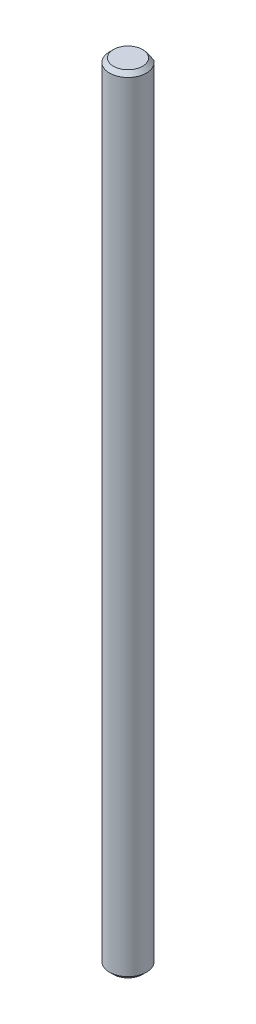
ISO-10303-21;
HEADER;
FILE_DESCRIPTION(('STEP AP214'),'2;1');
FILE_NAME('part.step','',(''),(''),'','','');
FILE_SCHEMA(('AUTOMOTIVE_DESIGN { 1 0 10303 214 1 1 1 1 }'));
ENDSEC;
DATA;
#1=APPLICATION_CONTEXT('core data for automotive mechanical design processes');
#2=APPLICATION_PROTOCOL_DEFINITION('international standard','automotive_design',2000,#1);
#3=PRODUCT_CONTEXT('',#1,'mechanical');
#4=PRODUCT('Part','Part','',(#3));
#5=PRODUCT_RELATED_PRODUCT_CATEGORY('part','',(#4));
#6=PRODUCT_DEFINITION_FORMATION('','',#4);
#7=PRODUCT_DEFINITION_CONTEXT('part definition',#1,'design');
#8=PRODUCT_DEFINITION('design','',#6,#7);
#9=PRODUCT_DEFINITION_SHAPE('','',#8);
#10=(LENGTH_UNIT() NAMED_UNIT(*) SI_UNIT(.MILLI.,.METRE.));
#11=(NAMED_UNIT(*) PLANE_ANGLE_UNIT() SI_UNIT($,.RADIAN.));
#12=(NAMED_UNIT(*) SI_UNIT($,.STERADIAN.) SOLID_ANGLE_UNIT());
#13=UNCERTAINTY_MEASURE_WITH_UNIT(LENGTH_MEASURE(1.E-05),#10,'distance_accuracy_value','');
#14=(GEOMETRIC_REPRESENTATION_CONTEXT(3) GLOBAL_UNCERTAINTY_ASSIGNED_CONTEXT((#13)) GLOBAL_UNIT_ASSIGNED_CONTEXT((#10,
#11,#12)) REPRESENTATION_CONTEXT('',''));
#15=CARTESIAN_POINT('',(0.,0.,0.));
#16=DIRECTION('',(0.,0.,1.));
#17=DIRECTION('',(1.,0.,0.));
#18=AXIS2_PLACEMENT_3D('',#15,#16,#17);
#19=CARTESIAN_POINT('',(0.,-50.,0.));
#20=DIRECTION('',(0.,-1.,0.));
#21=DIRECTION('',(1.,0.,0.));
#22=AXIS2_PLACEMENT_3D('',#19,#20,#21);
#23=PLANE('',#22);
#24=CARTESIAN_POINT('',(0.,-50.0000000000114,0.));
#25=DIRECTION('',(0.,1.,0.));
#26=DIRECTION('',(0.,0.,1.));
#27=AXIS2_PLACEMENT_3D('',#24,#25,#26);
#28=CIRCLE('',#27,1.84999999993351);
#29=CARTESIAN_POINT('',(0.,-50.0000000000114,1.84999999993351));
#30=VERTEX_POINT('',#29);
#31=EDGE_CURVE('E18',#30,#30,#28,.T.);
#32=ORIENTED_EDGE('',*,*,#31,.F.);
#33=EDGE_LOOP('',(#32));
#34=FACE_BOUND('',#33,.T.);
#35=ADVANCED_FACE('F15',(#34),#23,.T.);
#36=CARTESIAN_POINT('',(-1.85,50.,0.));
#37=DIRECTION('',(0.,1.,0.));
#38=DIRECTION('',(-1.,0.,0.));
#39=AXIS2_PLACEMENT_3D('',#36,#37,#38);
#40=PLANE('',#39);
#41=CARTESIAN_POINT('',(0.,50.0000000000114,0.));
#42=DIRECTION('',(0.,-1.,0.));
#43=DIRECTION('',(0.,0.,-1.));
#44=AXIS2_PLACEMENT_3D('',#41,#42,#43);
#45=CIRCLE('',#44,1.84999999999036);
#46=CARTESIAN_POINT('',(0.,50.0000000000114,-1.84999999999036));
#47=VERTEX_POINT('',#46);
#48=EDGE_CURVE('E47',#47,#47,#45,.T.);
#49=ORIENTED_EDGE('',*,*,#48,.F.);
#50=EDGE_LOOP('',(#49));
#51=FACE_BOUND('',#50,.T.);
#52=ADVANCED_FACE('F92',(#51),#40,.T.);
#53=CARTESIAN_POINT('',(0.,-49.4999999999663,0.));
#54=DIRECTION('',(0.,1.,0.));
#55=DIRECTION('',(0.,0.,1.));
#56=AXIS2_PLACEMENT_3D('',#53,#54,#55);
#57=CONICAL_SURFACE('',#56,2.35000000003538,0.785398163454292);
#58=ORIENTED_EDGE('',*,*,#31,.T.);
#59=EDGE_LOOP('',(#58));
#60=FACE_BOUND('',#59,.T.);
#61=CARTESIAN_POINT('',(0.,-49.5,0.));
#62=DIRECTION('',(0.,1.,0.));
#63=DIRECTION('',(-1.,0.,0.));
#64=AXIS2_PLACEMENT_3D('',#61,#62,#63);
#65=CIRCLE('',#64,2.34999999999999);
#66=CARTESIAN_POINT('',(-1.42323534764236,-49.500000243665,-1.87));
#67=VERTEX_POINT('',#66);
#68=CARTESIAN_POINT('',(1.42323462760378,-49.5000006797432,-1.87));
#69=VERTEX_POINT('',#68);
#70=EDGE_CURVE('E48',#67,#69,#65,.T.);
#71=ORIENTED_EDGE('',*,*,#70,.F.);
#72=CARTESIAN_POINT('',(-1.42323498378485,-49.5000005508551,-1.87000014038777));
#73=CARTESIAN_POINT('',(-1.35418817664827,-49.5417684632873,-1.87000005053875));
#74=CARTESIAN_POINT('',(-1.28428005161818,-49.5822263208198,-1.87000001357401));
#75=CARTESIAN_POINT('',(-1.14218468500488,-49.659597976272,-1.86999998637286));
#76=CARTESIAN_POINT('',(-1.06998959252105,-49.6964972798566,-1.86999999631996));
#77=CARTESIAN_POINT('',(-0.921895947289953,-49.7661442259493,-1.8700000037505));
#78=CARTESIAN_POINT('',(-0.845952955132971,-49.7987988696207,-1.87000000099171));
#79=CARTESIAN_POINT('',(-0.691616459482524,-49.8574751674493,-1.86999999900981));
#80=CARTESIAN_POINT('',(-0.613226862641982,-49.8835068439403,-1.86999999978133));
#81=CARTESIAN_POINT('',(-0.479182866712584,-49.9202926551231,-1.87000000014983));
#82=CARTESIAN_POINT('',(-0.424141514682739,-49.9332763724717,-1.87000000004014));
#83=CARTESIAN_POINT('',(-0.313171322830666,-49.954738551357,-1.86999999995987));
#84=CARTESIAN_POINT('',(-0.257242475405086,-49.9632169742746,-1.8699999999893));
#85=CARTESIAN_POINT('',(-0.145366352650471,-49.9751751810981,-1.87000000001061));
#86=CARTESIAN_POINT('',(-0.0894239840416926,-49.978700250427,-1.87000000000285));
#87=CARTESIAN_POINT('',(0.0225499865273419,-49.9807019187033,-1.86999999999716));
#88=CARTESIAN_POINT('',(0.0785815846536717,-49.9791787290053,-1.86999999999924));
#89=CARTESIAN_POINT('',(0.190200009157418,-49.971175482336,-1.87000000000077));
#90=CARTESIAN_POINT('',(0.245787382268125,-49.9647029657744,-1.87000000000021));
#91=CARTESIAN_POINT('',(0.356240000227504,-49.947152770313,-1.8699999999998));
#92=CARTESIAN_POINT('',(0.411104874902264,-49.936072818769,-1.86999999999993));
#93=CARTESIAN_POINT('',(0.575088112093169,-49.8964582598053,-1.87000000000015));
#94=CARTESIAN_POINT('',(0.682710045112367,-49.8616255993898,-1.87000000000003));
#95=CARTESIAN_POINT('',(0.843715590708974,-49.7991245084334,-1.86999999999999));
#96=CARTESIAN_POINT('',(0.898885600992475,-49.7757462694812,-1.87));
#97=CARTESIAN_POINT('',(1.0079828095392,-49.7261890409873,-1.87000000000001));
#98=CARTESIAN_POINT('',(1.06190968444336,-49.7000093325114,-1.87000000000001));
#99=CARTESIAN_POINT('',(1.16766384505703,-49.645843484592,-1.87));
#100=CARTESIAN_POINT('',(1.21951129441643,-49.6178962101573,-1.87));
#101=CARTESIAN_POINT('',(1.32213346308007,-49.5602061758245,-1.87000000000001));
#102=CARTESIAN_POINT('',(1.37290918064455,-49.5304651962072,-1.87000000000001));
#103=CARTESIAN_POINT('',(1.42323358507355,-49.5000013111337,-1.87000000000001));
#104=B_SPLINE_CURVE_WITH_KNOTS('',3,(#72,#73,#74,#75,#76,#77,#78,#79,#80,#81,#82,#83,#84,#85,
#86,#87,#88,#89,#90,#91,#92,#93,#94,#95,#96,#97,#98,#99,#100,#101,#102,#103),.UNSPECIFIED.,.F.,
.F.,(4,2,2,2,2,2,2,2,2,2,2,2,2,2,2,4),(0.,0.242165576525823,0.485279183301244,0.733046787022982,
0.980437191076499,1.14993280226235,1.31942986633639,1.48736701288445,1.6552971285237,
1.82297190738139,1.99072949108785,2.32888004133284,2.50859200291018,2.68835019463475,
2.86501326623594,3.04150379386995),.UNSPECIFIED.);
#105=EDGE_CURVE('E40',#67,#69,#104,.T.);
#106=ORIENTED_EDGE('',*,*,#105,.T.);
#107=EDGE_LOOP('',(#71,#106));
#108=FACE_BOUND('',#107,.T.);
#109=ADVANCED_FACE('F49',(#60,#108),#57,.T.);
#110=CARTESIAN_POINT('',(0.,-50.,-1.87000000000001));
#111=DIRECTION('',(0.,0.,1.));
#112=DIRECTION('',(1.,0.,0.));
#113=AXIS2_PLACEMENT_3D('',#110,#111,#112);
#114=PLANE('',#113);
#115=CARTESIAN_POINT('',(1.42323690101391,49.4999993028939,-1.87000000000001));
#116=CARTESIAN_POINT('',(1.35419009472602,49.5417673066685,-1.87000000000001));
#117=CARTESIAN_POINT('',(1.28428195715561,49.5822252331758,-1.87000000000001));
#118=CARTESIAN_POINT('',(1.1421865542053,49.6595970094864,-1.87000000000001));
#119=CARTESIAN_POINT('',(1.06999143790243,49.6964963649345,-1.87000000000001));
#120=CARTESIAN_POINT('',(0.921897740908179,49.7661434302724,-1.87000000000001));
#121=CARTESIAN_POINT('',(0.845954720653814,49.7987981411116,-1.87000000000001));
#122=CARTESIAN_POINT('',(0.691618164416713,49.8574745764396,-1.87000000000001));
#123=CARTESIAN_POINT('',(0.613228535078765,49.8835063232211,-1.87000000000001));
#124=CARTESIAN_POINT('',(0.479184506187486,49.9202922475761,-1.87000000000001));
#125=CARTESIAN_POINT('',(0.424143155755424,49.9332760090939,-1.87000000000001));
#126=CARTESIAN_POINT('',(0.313172964139737,49.9547382799573,-1.87000000000001));
#127=CARTESIAN_POINT('',(0.257244115354621,49.9632167506934,-1.87000000000001));
#128=CARTESIAN_POINT('',(0.145367987246501,49.9751750543069,-1.87000000000001));
#129=CARTESIAN_POINT('',(0.0894256146951669,49.9787001727176,-1.87000000000001));
#130=CARTESIAN_POINT('',(-0.0225483682368413,49.9807019384361,-1.87000000000001));
#131=CARTESIAN_POINT('',(-0.0785799747834129,49.979178797098,-1.87000000000001));
#132=CARTESIAN_POINT('',(-0.190198422823108,49.9711756434597,-1.87000000000001));
#133=CARTESIAN_POINT('',(-0.245785811026135,49.9647031713364,-1.87000000000001));
#134=CARTESIAN_POINT('',(-0.356238461953535,49.9471530590305,-1.87000000000001));
#135=CARTESIAN_POINT('',(-0.411103354505624,49.9360731462025,-1.87000000000001));
#136=CARTESIAN_POINT('',(-0.575086652121821,49.8964586928644,-1.87000000000001));
#137=CARTESIAN_POINT('',(-0.682708629689933,49.8616260884606,-1.87000000000001));
#138=CARTESIAN_POINT('',(-0.843714607573762,49.7991249223591,-1.87000000000001));
#139=CARTESIAN_POINT('',(-0.898884997287229,49.7757465389586,-1.87000000000001));
#140=CARTESIAN_POINT('',(-1.00798294807066,49.7261889828608,-1.87000000000001));
#141=CARTESIAN_POINT('',(-1.06191018576471,49.7000090911917,-1.87000000000001));
#142=CARTESIAN_POINT('',(-1.16766504330868,49.6458428556734,-1.87000000000001));
#143=CARTESIAN_POINT('',(-1.2195128272266,49.617895377614,-1.87000000000001));
#144=CARTESIAN_POINT('',(-1.32213565126447,49.56020491691,-1.87000000000001));
#145=CARTESIAN_POINT('',(-1.37291168968057,49.5304637146085,-1.87000000000001));
#146=CARTESIAN_POINT('',(-1.42323641006309,49.4999996002296,-1.87000000000001));
#147=B_SPLINE_CURVE_WITH_KNOTS('',3,(#115,#116,#117,#118,#119,#120,#121,#122,#123,#124,#125,
#126,#127,#128,#129,#130,#131,#132,#133,#134,#135,#136,#137,#138,#139,#140,#141,#142,#143,#144,
#145,#146),.UNSPECIFIED.,.F.,.F.,(4,2,2,2,2,2,2,2,2,2,2,2,2,2,2,4),(0.,0.242165712962312,
0.485279453698024,0.733047215432901,0.980437778634138,1.14993341592842,1.31943050575031,
1.48736767343369,1.65529781022806,1.82297261827997,1.99073023113985,2.32888085368115,
2.50859403086456,2.688353440281,2.86501768462266,3.04150937970759),.UNSPECIFIED.);
#148=CARTESIAN_POINT('',(1.42323632549647,49.4999996514449,-1.87));
#149=VERTEX_POINT('',#148);
#150=CARTESIAN_POINT('',(-1.42323610566057,49.4999997845856,-1.87));
#151=VERTEX_POINT('',#150);
#152=EDGE_CURVE('E32',#149,#151,#147,.T.);
#153=ORIENTED_EDGE('',*,*,#152,.F.);
#154=DIRECTION('',(0.,1.,0.));
#155=VECTOR('',#154,1.);
#156=CARTESIAN_POINT('',(1.42323574997256,50.,-1.87));
#157=LINE('',#156,#155);
#158=EDGE_CURVE('E24',#69,#149,#157,.T.);
#159=ORIENTED_EDGE('',*,*,#158,.F.);
#160=ORIENTED_EDGE('',*,*,#105,.F.);
#161=DIRECTION('',(0.,1.,0.));
#162=VECTOR('',#161,1.);
#163=CARTESIAN_POINT('',(-1.42323574997256,50.,-1.87));
#164=LINE('',#163,#162);
#165=EDGE_CURVE('E44',#151,#67,#164,.F.);
#166=ORIENTED_EDGE('',*,*,#165,.F.);
#167=EDGE_LOOP('',(#153,#159,#160,#166));
#168=FACE_BOUND('',#167,.T.);
#169=ADVANCED_FACE('F42',(#168),#114,.F.);
#170=CARTESIAN_POINT('',(0.,49.5000000000232,0.));
#171=DIRECTION('',(0.,-1.,0.));
#172=DIRECTION('',(0.,0.,-1.));
#173=AXIS2_PLACEMENT_3D('',#170,#171,#172);
#174=CONICAL_SURFACE('',#173,2.34999999997854,0.785398163397448);
#175=ORIENTED_EDGE('',*,*,#48,.T.);
#176=EDGE_LOOP('',(#175));
#177=FACE_BOUND('',#176,.T.);
#178=CARTESIAN_POINT('',(0.,49.5,0.));
#179=DIRECTION('',(0.,1.,0.));
#180=DIRECTION('',(-1.,0.,0.));
#181=AXIS2_PLACEMENT_3D('',#178,#179,#180);
#182=CIRCLE('',#181,2.34999999999999);
#183=EDGE_CURVE('E10',#149,#151,#182,.F.);
#184=ORIENTED_EDGE('',*,*,#183,.F.);
#185=ORIENTED_EDGE('',*,*,#152,.T.);
#186=EDGE_LOOP('',(#184,#185));
#187=FACE_BOUND('',#186,.T.);
#188=ADVANCED_FACE('F66',(#177,#187),#174,.T.);
#189=CARTESIAN_POINT('',(0.,50.,0.));
#190=DIRECTION('',(0.,1.,0.));
#191=DIRECTION('',(-1.,0.,0.));
#192=AXIS2_PLACEMENT_3D('',#189,#190,#191);
#193=CYLINDRICAL_SURFACE('',#192,2.34999999999999);
#194=ORIENTED_EDGE('',*,*,#183,.T.);
#195=ORIENTED_EDGE('',*,*,#165,.T.);
#196=ORIENTED_EDGE('',*,*,#70,.T.);
#197=ORIENTED_EDGE('',*,*,#158,.T.);
#198=EDGE_LOOP('',(#194,#195,#196,#197));
#199=FACE_BOUND('',#198,.T.);
#200=ADVANCED_FACE('F52',(#199),#193,.T.);
#201=CLOSED_SHELL('',(#35,#52,#109,#169,#188,#200));
#202=MANIFOLD_SOLID_BREP('B1',#201);
#203=ADVANCED_BREP_SHAPE_REPRESENTATION('',(#18,#202),#14);
#204=SHAPE_DEFINITION_REPRESENTATION(#9,#203);
ENDSEC;
END-ISO-10303-21;
